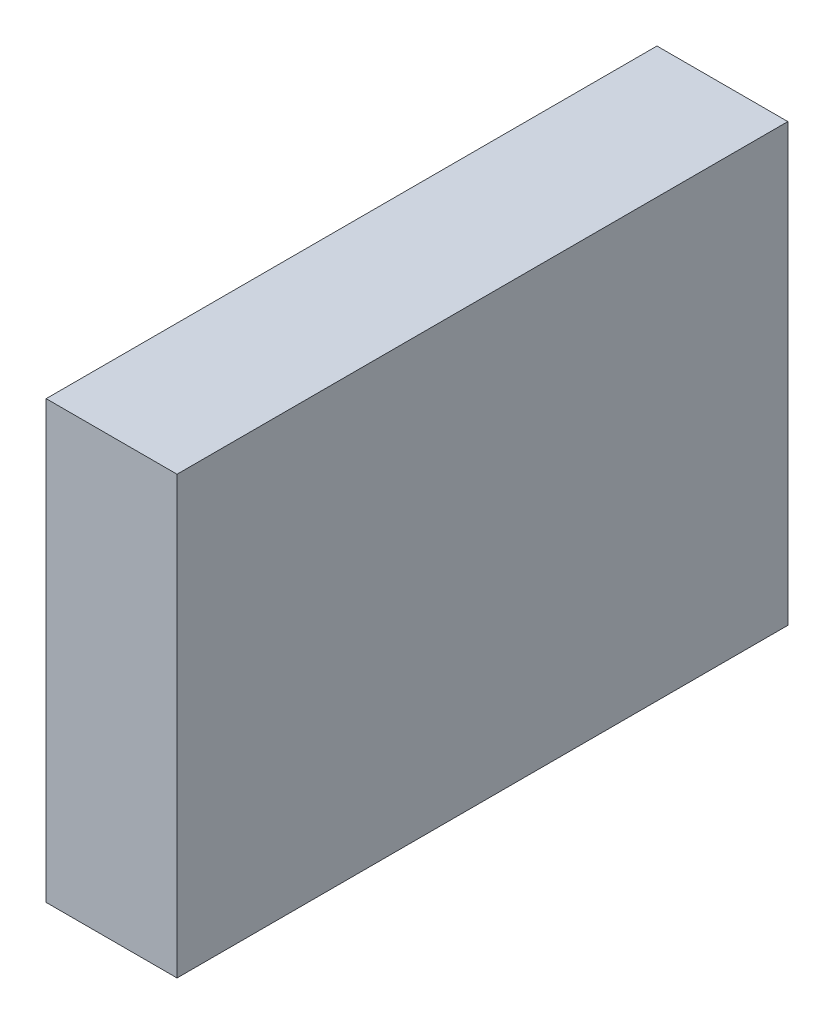
ISO-10303-21;
HEADER;
FILE_DESCRIPTION(('STEP AP214'),'2;1');
FILE_NAME('part.step','',(''),(''),'','','');
FILE_SCHEMA(('AUTOMOTIVE_DESIGN { 1 0 10303 214 1 1 1 1 }'));
ENDSEC;
DATA;
#1=APPLICATION_CONTEXT('core data for automotive mechanical design processes');
#2=APPLICATION_PROTOCOL_DEFINITION('international standard','automotive_design',2000,#1);
#3=PRODUCT_CONTEXT('',#1,'mechanical');
#4=PRODUCT('Part','Part','',(#3));
#5=PRODUCT_RELATED_PRODUCT_CATEGORY('part','',(#4));
#6=PRODUCT_DEFINITION_FORMATION('','',#4);
#7=PRODUCT_DEFINITION_CONTEXT('part definition',#1,'design');
#8=PRODUCT_DEFINITION('design','',#6,#7);
#9=PRODUCT_DEFINITION_SHAPE('','',#8);
#10=(LENGTH_UNIT() NAMED_UNIT(*) SI_UNIT(.MILLI.,.METRE.));
#11=(NAMED_UNIT(*) PLANE_ANGLE_UNIT() SI_UNIT($,.RADIAN.));
#12=(NAMED_UNIT(*) SI_UNIT($,.STERADIAN.) SOLID_ANGLE_UNIT());
#13=UNCERTAINTY_MEASURE_WITH_UNIT(LENGTH_MEASURE(1.E-05),#10,'distance_accuracy_value','');
#14=(GEOMETRIC_REPRESENTATION_CONTEXT(3) GLOBAL_UNCERTAINTY_ASSIGNED_CONTEXT((#13)) GLOBAL_UNIT_ASSIGNED_CONTEXT((#10,
#11,#12)) REPRESENTATION_CONTEXT('',''));
#15=CARTESIAN_POINT('',(0.,0.,0.));
#16=DIRECTION('',(0.,0.,1.));
#17=DIRECTION('',(1.,0.,0.));
#18=AXIS2_PLACEMENT_3D('',#15,#16,#17);
#19=CARTESIAN_POINT('',(3.9,0.679999822530764,-3.72112146154861));
#20=DIRECTION('',(1.,0.,0.));
#21=DIRECTION('',(0.,1.,8.74227765734759E-08));
#22=AXIS2_PLACEMENT_3D('',#19,#20,#21);
#23=PLANE('',#22);
#24=DIRECTION('',(0.,-8.74227766369168E-08,0.999999999999996));
#25=VECTOR('',#24,1.);
#26=CARTESIAN_POINT('',(3.9,1.74999981641217,-3.65112136800624));
#27=LINE('',#26,#25);
#28=CARTESIAN_POINT('',(3.9,1.74999981641217,-3.65112136800523));
#29=VERTEX_POINT('',#28);
#30=CARTESIAN_POINT('',(3.9,1.74999969401928,-2.25112136800623));
#31=VERTEX_POINT('',#30);
#32=EDGE_CURVE('E11',#29,#31,#27,.T.);
#33=ORIENTED_EDGE('',*,*,#32,.F.);
#34=DIRECTION('',(0.,0.999999999999996,8.74227765733007E-08));
#35=VECTOR('',#34,1.);
#36=CARTESIAN_POINT('',(3.9,0.749999816410169,-3.65112145542901));
#37=LINE('',#36,#35);
#38=CARTESIAN_POINT('',(3.9,0.749999816411169,-3.65112145542901));
#39=VERTEX_POINT('',#38);
#40=EDGE_CURVE('E59',#39,#29,#37,.T.);
#41=ORIENTED_EDGE('',*,*,#40,.F.);
#42=DIRECTION('',(0.,8.74227765576152E-08,-0.999999999999996));
#43=VECTOR('',#42,1.);
#44=CARTESIAN_POINT('',(3.9,0.749999694018282,-2.25112145542901));
#45=LINE('',#44,#43);
#46=CARTESIAN_POINT('',(3.9,0.749999694018282,-2.25112145543001));
#47=VERTEX_POINT('',#46);
#48=EDGE_CURVE('E79',#47,#39,#45,.T.);
#49=ORIENTED_EDGE('',*,*,#48,.F.);
#50=DIRECTION('',(0.,-0.999999999999996,-8.74227765733007E-08));
#51=VECTOR('',#50,1.);
#52=CARTESIAN_POINT('',(3.9,1.74999969402028,-2.25112136800623));
#53=LINE('',#52,#51);
#54=EDGE_CURVE('E84',#31,#47,#53,.T.);
#55=ORIENTED_EDGE('',*,*,#54,.F.);
#56=EDGE_LOOP('',(#33,#41,#49,#55));
#57=FACE_BOUND('',#56,.T.);
#58=ADVANCED_FACE('F17',(#57),#23,.F.);
#59=CARTESIAN_POINT('',(4.2,0.679999822530764,-3.72112146154861));
#60=DIRECTION('',(1.,0.,0.));
#61=DIRECTION('',(0.,1.,8.74227765734759E-08));
#62=AXIS2_PLACEMENT_3D('',#59,#60,#61);
#63=PLANE('',#62);
#64=DIRECTION('',(0.,-0.999999999999996,-8.74227765733007E-08));
#65=VECTOR('',#64,1.);
#66=CARTESIAN_POINT('',(4.2,1.74999969402028,-2.25112136800623));
#67=LINE('',#66,#65);
#68=CARTESIAN_POINT('',(4.2,1.74999969401928,-2.25112136800623));
#69=VERTEX_POINT('',#68);
#70=CARTESIAN_POINT('',(4.2,0.749999694018282,-2.25112145543001));
#71=VERTEX_POINT('',#70);
#72=EDGE_CURVE('E24',#69,#71,#67,.T.);
#73=ORIENTED_EDGE('',*,*,#72,.T.);
#74=DIRECTION('',(0.,8.74227765576152E-08,-0.999999999999996));
#75=VECTOR('',#74,1.);
#76=CARTESIAN_POINT('',(4.2,0.749999694018282,-2.25112145542901));
#77=LINE('',#76,#75);
#78=CARTESIAN_POINT('',(4.2,0.749999816411169,-3.65112145542901));
#79=VERTEX_POINT('',#78);
#80=EDGE_CURVE('E82',#71,#79,#77,.T.);
#81=ORIENTED_EDGE('',*,*,#80,.T.);
#82=DIRECTION('',(0.,0.999999999999996,8.74227765733007E-08));
#83=VECTOR('',#82,1.);
#84=CARTESIAN_POINT('',(4.2,0.749999816410169,-3.65112145542901));
#85=LINE('',#84,#83);
#86=CARTESIAN_POINT('',(4.2,1.74999981641217,-3.65112136800523));
#87=VERTEX_POINT('',#86);
#88=EDGE_CURVE('E64',#79,#87,#85,.T.);
#89=ORIENTED_EDGE('',*,*,#88,.T.);
#90=DIRECTION('',(0.,-8.74227764783136E-08,0.999999999999996));
#91=VECTOR('',#90,1.);
#92=CARTESIAN_POINT('',(4.2,1.74999981641217,-3.65112136800623));
#93=LINE('',#92,#91);
#94=EDGE_CURVE('E61',#87,#69,#93,.T.);
#95=ORIENTED_EDGE('',*,*,#94,.T.);
#96=EDGE_LOOP('',(#73,#81,#89,#95));
#97=FACE_BOUND('',#96,.T.);
#98=ADVANCED_FACE('F62',(#97),#63,.T.);
#99=CARTESIAN_POINT('',(3.9,1.74999969402028,-2.25112136800623));
#100=DIRECTION('',(0.,-8.74227765734759E-08,1.));
#101=DIRECTION('',(0.,-1.,-8.74227765734759E-08));
#102=AXIS2_PLACEMENT_3D('',#99,#100,#101);
#103=PLANE('',#102);
#104=ORIENTED_EDGE('',*,*,#54,.T.);
#105=DIRECTION('',(1.,0.,0.));
#106=VECTOR('',#105,1.);
#107=CARTESIAN_POINT('',(3.9,0.749999694018282,-2.25112145542901));
#108=LINE('',#107,#106);
#109=EDGE_CURVE('E57',#47,#71,#108,.T.);
#110=ORIENTED_EDGE('',*,*,#109,.T.);
#111=ORIENTED_EDGE('',*,*,#72,.F.);
#112=DIRECTION('',(1.,0.,0.));
#113=VECTOR('',#112,1.);
#114=CARTESIAN_POINT('',(3.9,1.74999969402028,-2.25112136800623));
#115=LINE('',#114,#113);
#116=EDGE_CURVE('E55',#31,#69,#115,.T.);
#117=ORIENTED_EDGE('',*,*,#116,.F.);
#118=EDGE_LOOP('',(#104,#110,#111,#117));
#119=FACE_BOUND('',#118,.T.);
#120=ADVANCED_FACE('F53',(#119),#103,.T.);
#121=CARTESIAN_POINT('',(3.9,0.749999694018282,-2.25112145542901));
#122=DIRECTION('',(0.,-1.,-8.74227765734759E-08));
#123=DIRECTION('',(0.,8.74227765734759E-08,-1.));
#124=AXIS2_PLACEMENT_3D('',#121,#122,#123);
#125=PLANE('',#124);
#126=ORIENTED_EDGE('',*,*,#48,.T.);
#127=DIRECTION('',(1.,0.,0.));
#128=VECTOR('',#127,1.);
#129=CARTESIAN_POINT('',(3.9,0.749999816410169,-3.65112145542901));
#130=LINE('',#129,#128);
#131=EDGE_CURVE('E68',#39,#79,#130,.T.);
#132=ORIENTED_EDGE('',*,*,#131,.T.);
#133=ORIENTED_EDGE('',*,*,#80,.F.);
#134=ORIENTED_EDGE('',*,*,#109,.F.);
#135=EDGE_LOOP('',(#126,#132,#133,#134));
#136=FACE_BOUND('',#135,.T.);
#137=ADVANCED_FACE('F91',(#136),#125,.T.);
#138=CARTESIAN_POINT('',(3.9,0.749999816410169,-3.65112145542901));
#139=DIRECTION('',(0.,8.74227765734759E-08,-1.));
#140=DIRECTION('',(0.,1.,8.74227765734759E-08));
#141=AXIS2_PLACEMENT_3D('',#138,#139,#140);
#142=PLANE('',#141);
#143=ORIENTED_EDGE('',*,*,#40,.T.);
#144=DIRECTION('',(1.,0.,0.));
#145=VECTOR('',#144,1.);
#146=CARTESIAN_POINT('',(3.9,1.74999981641217,-3.65112136800623));
#147=LINE('',#146,#145);
#148=EDGE_CURVE('E69',#29,#87,#147,.T.);
#149=ORIENTED_EDGE('',*,*,#148,.T.);
#150=ORIENTED_EDGE('',*,*,#88,.F.);
#151=ORIENTED_EDGE('',*,*,#131,.F.);
#152=EDGE_LOOP('',(#143,#149,#150,#151));
#153=FACE_BOUND('',#152,.T.);
#154=ADVANCED_FACE('F88',(#153),#142,.T.);
#155=CARTESIAN_POINT('',(3.9,1.74999981641217,-3.65112136800623));
#156=DIRECTION('',(0.,1.,8.74227765734759E-08));
#157=DIRECTION('',(0.,-8.74227765734759E-08,1.));
#158=AXIS2_PLACEMENT_3D('',#155,#156,#157);
#159=PLANE('',#158);
#160=ORIENTED_EDGE('',*,*,#32,.T.);
#161=ORIENTED_EDGE('',*,*,#116,.T.);
#162=ORIENTED_EDGE('',*,*,#94,.F.);
#163=ORIENTED_EDGE('',*,*,#148,.F.);
#164=EDGE_LOOP('',(#160,#161,#162,#163));
#165=FACE_BOUND('',#164,.T.);
#166=ADVANCED_FACE('F71',(#165),#159,.T.);
#167=CLOSED_SHELL('',(#58,#98,#120,#137,#154,#166));
#168=MANIFOLD_SOLID_BREP('B1',#167);
#169=ADVANCED_BREP_SHAPE_REPRESENTATION('',(#18,#168),#14);
#170=SHAPE_DEFINITION_REPRESENTATION(#9,#169);
ENDSEC;
END-ISO-10303-21;
